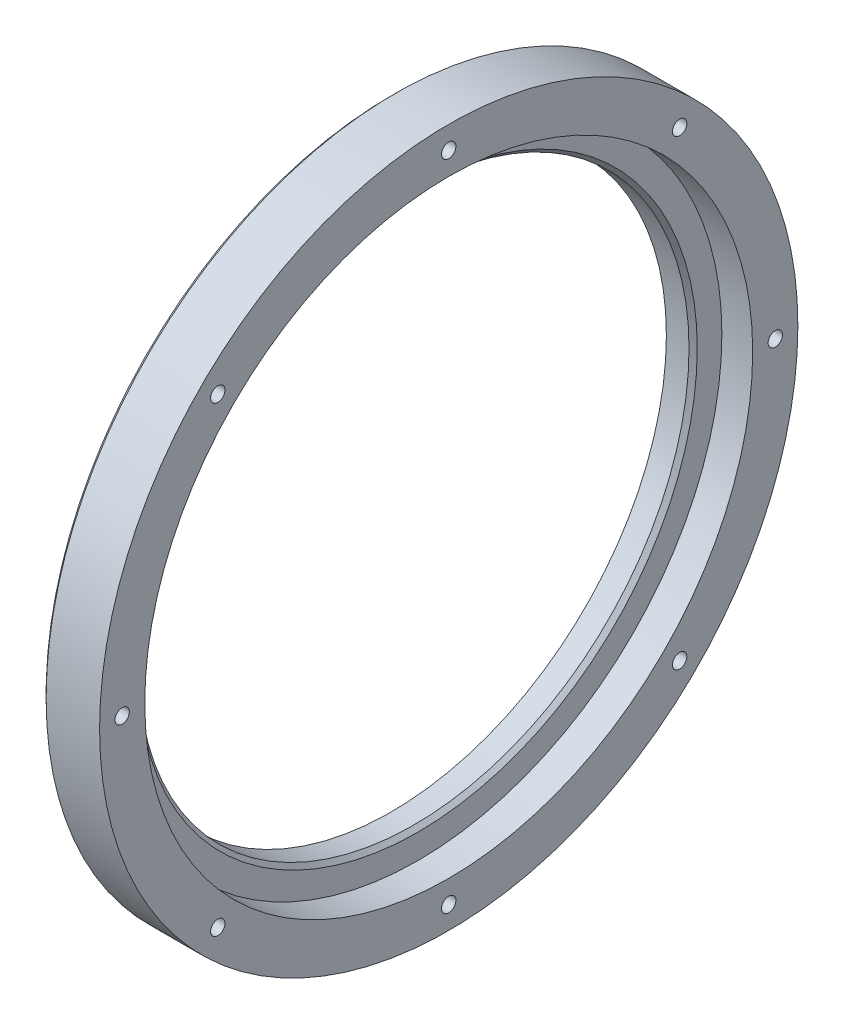
ISO-10303-21;
HEADER;
FILE_DESCRIPTION(('STEP AP214'),'2;1');
FILE_NAME('part.step','',(''),(''),'','','');
FILE_SCHEMA(('AUTOMOTIVE_DESIGN { 1 0 10303 214 1 1 1 1 }'));
ENDSEC;
DATA;
#1=APPLICATION_CONTEXT('core data for automotive mechanical design processes');
#2=APPLICATION_PROTOCOL_DEFINITION('international standard','automotive_design',2000,#1);
#3=PRODUCT_CONTEXT('',#1,'mechanical');
#4=PRODUCT('Part','Part','',(#3));
#5=PRODUCT_RELATED_PRODUCT_CATEGORY('part','',(#4));
#6=PRODUCT_DEFINITION_FORMATION('','',#4);
#7=PRODUCT_DEFINITION_CONTEXT('part definition',#1,'design');
#8=PRODUCT_DEFINITION('design','',#6,#7);
#9=PRODUCT_DEFINITION_SHAPE('','',#8);
#10=(LENGTH_UNIT() NAMED_UNIT(*) SI_UNIT(.MILLI.,.METRE.));
#11=(NAMED_UNIT(*) PLANE_ANGLE_UNIT() SI_UNIT($,.RADIAN.));
#12=(NAMED_UNIT(*) SI_UNIT($,.STERADIAN.) SOLID_ANGLE_UNIT());
#13=UNCERTAINTY_MEASURE_WITH_UNIT(LENGTH_MEASURE(1.E-05),#10,'distance_accuracy_value','');
#14=(GEOMETRIC_REPRESENTATION_CONTEXT(3) GLOBAL_UNCERTAINTY_ASSIGNED_CONTEXT((#13)) GLOBAL_UNIT_ASSIGNED_CONTEXT((#10,
#11,#12)) REPRESENTATION_CONTEXT('',''));
#15=CARTESIAN_POINT('',(0.,0.,0.));
#16=DIRECTION('',(0.,0.,1.));
#17=DIRECTION('',(1.,0.,0.));
#18=AXIS2_PLACEMENT_3D('',#15,#16,#17);
#19=CARTESIAN_POINT('',(-272.858046522507,57.2242590790327,56.2149891043305));
#20=DIRECTION('',(-1.,0.,0.));
#21=DIRECTION('',(0.,0.,1.));
#22=AXIS2_PLACEMENT_3D('',#19,#20,#21);
#23=CYLINDRICAL_SURFACE('',#22,1.75000000000001);
#24=CARTESIAN_POINT('',(-272.858046522507,57.2242590790327,56.2149891043305));
#25=DIRECTION('',(-1.,0.,0.));
#26=DIRECTION('',(0.,0.,1.));
#27=AXIS2_PLACEMENT_3D('',#24,#25,#26);
#28=CIRCLE('',#27,1.75000000000001);
#29=CARTESIAN_POINT('',(-272.858046522507,57.2242590790327,57.9649891043306));
#30=VERTEX_POINT('',#29);
#31=EDGE_CURVE('E90',#30,#30,#28,.T.);
#32=ORIENTED_EDGE('',*,*,#31,.F.);
#33=EDGE_LOOP('',(#32));
#34=FACE_BOUND('',#33,.T.);
#35=CARTESIAN_POINT('',(-282.871214875946,57.2242590790327,56.2149891043305));
#36=DIRECTION('',(-1.,0.,0.));
#37=DIRECTION('',(0.,0.,1.));
#38=AXIS2_PLACEMENT_3D('',#35,#36,#37);
#39=CIRCLE('',#38,1.75000000000001);
#40=CARTESIAN_POINT('',(-282.871214875946,57.2242590790327,57.9649891043306));
#41=VERTEX_POINT('',#40);
#42=EDGE_CURVE('E53',#41,#41,#39,.F.);
#43=ORIENTED_EDGE('',*,*,#42,.F.);
#44=EDGE_LOOP('',(#43));
#45=FACE_BOUND('',#44,.T.);
#46=ADVANCED_FACE('F35',(#34,#45),#23,.F.);
#47=CARTESIAN_POINT('',(-272.858046522507,80.5092699747022,0.));
#48=DIRECTION('',(-1.,0.,0.));
#49=DIRECTION('',(0.,0.,1.));
#50=AXIS2_PLACEMENT_3D('',#47,#48,#49);
#51=CYLINDRICAL_SURFACE('',#50,1.75000000000001);
#52=CARTESIAN_POINT('',(-272.858046522507,80.5092699747022,0.));
#53=DIRECTION('',(-1.,0.,0.));
#54=DIRECTION('',(0.,0.,1.));
#55=AXIS2_PLACEMENT_3D('',#52,#53,#54);
#56=CIRCLE('',#55,1.75000000000001);
#57=CARTESIAN_POINT('',(-272.858046522507,80.5092699747022,1.75000000000001));
#58=VERTEX_POINT('',#57);
#59=EDGE_CURVE('E125',#58,#58,#56,.T.);
#60=ORIENTED_EDGE('',*,*,#59,.F.);
#61=EDGE_LOOP('',(#60));
#62=FACE_BOUND('',#61,.T.);
#63=CARTESIAN_POINT('',(-282.871214875946,80.5092699747022,0.));
#64=DIRECTION('',(-1.,0.,0.));
#65=DIRECTION('',(0.,0.,1.));
#66=AXIS2_PLACEMENT_3D('',#63,#64,#65);
#67=CIRCLE('',#66,1.75000000000001);
#68=CARTESIAN_POINT('',(-282.871214875946,80.5092699747022,1.75000000000001));
#69=VERTEX_POINT('',#68);
#70=EDGE_CURVE('E58',#69,#69,#67,.F.);
#71=ORIENTED_EDGE('',*,*,#70,.F.);
#72=EDGE_LOOP('',(#71));
#73=FACE_BOUND('',#72,.T.);
#74=ADVANCED_FACE('F230',(#62,#73),#51,.F.);
#75=CARTESIAN_POINT('',(-272.858046522507,57.2242590790327,-56.2149891043305));
#76=DIRECTION('',(-1.,0.,0.));
#77=DIRECTION('',(0.,0.,1.));
#78=AXIS2_PLACEMENT_3D('',#75,#76,#77);
#79=CYLINDRICAL_SURFACE('',#78,1.75000000000001);
#80=CARTESIAN_POINT('',(-272.858046522507,57.2242590790327,-56.2149891043305));
#81=DIRECTION('',(-1.,0.,0.));
#82=DIRECTION('',(0.,0.,1.));
#83=AXIS2_PLACEMENT_3D('',#80,#81,#82);
#84=CIRCLE('',#83,1.75000000000001);
#85=CARTESIAN_POINT('',(-272.858046522507,57.2242590790327,-54.4649891043305));
#86=VERTEX_POINT('',#85);
#87=EDGE_CURVE('E122',#86,#86,#84,.T.);
#88=ORIENTED_EDGE('',*,*,#87,.F.);
#89=EDGE_LOOP('',(#88));
#90=FACE_BOUND('',#89,.T.);
#91=CARTESIAN_POINT('',(-282.871214875946,57.2242590790327,-56.2149891043305));
#92=DIRECTION('',(-1.,0.,0.));
#93=DIRECTION('',(0.,0.,1.));
#94=AXIS2_PLACEMENT_3D('',#91,#92,#93);
#95=CIRCLE('',#94,1.75000000000001);
#96=CARTESIAN_POINT('',(-282.871214875946,57.2242590790327,-54.4649891043305));
#97=VERTEX_POINT('',#96);
#98=EDGE_CURVE('E63',#97,#97,#95,.F.);
#99=ORIENTED_EDGE('',*,*,#98,.F.);
#100=EDGE_LOOP('',(#99));
#101=FACE_BOUND('',#100,.T.);
#102=ADVANCED_FACE('F236',(#90,#101),#79,.F.);
#103=CARTESIAN_POINT('',(-272.858046522507,1.00926997470218,-79.5));
#104=DIRECTION('',(-1.,0.,0.));
#105=DIRECTION('',(0.,0.,1.));
#106=AXIS2_PLACEMENT_3D('',#103,#104,#105);
#107=CYLINDRICAL_SURFACE('',#106,1.75);
#108=CARTESIAN_POINT('',(-272.858046522507,1.00926997470218,-79.5));
#109=DIRECTION('',(-1.,0.,0.));
#110=DIRECTION('',(0.,0.,1.));
#111=AXIS2_PLACEMENT_3D('',#108,#109,#110);
#112=CIRCLE('',#111,1.75);
#113=CARTESIAN_POINT('',(-272.858046522507,1.00926997470218,-77.75));
#114=VERTEX_POINT('',#113);
#115=EDGE_CURVE('E119',#114,#114,#112,.T.);
#116=ORIENTED_EDGE('',*,*,#115,.F.);
#117=EDGE_LOOP('',(#116));
#118=FACE_BOUND('',#117,.T.);
#119=CARTESIAN_POINT('',(-282.871214875946,1.00926997470218,-79.5));
#120=DIRECTION('',(-1.,0.,0.));
#121=DIRECTION('',(0.,0.,1.));
#122=AXIS2_PLACEMENT_3D('',#119,#120,#121);
#123=CIRCLE('',#122,1.75);
#124=CARTESIAN_POINT('',(-282.871214875946,1.00926997470218,-77.75));
#125=VERTEX_POINT('',#124);
#126=EDGE_CURVE('E68',#125,#125,#123,.F.);
#127=ORIENTED_EDGE('',*,*,#126,.F.);
#128=EDGE_LOOP('',(#127));
#129=FACE_BOUND('',#128,.T.);
#130=ADVANCED_FACE('F247',(#118,#129),#107,.F.);
#131=CARTESIAN_POINT('',(-272.858046522507,-55.2057191296284,-56.2149891043306));
#132=DIRECTION('',(-1.,0.,0.));
#133=DIRECTION('',(0.,0.,1.));
#134=AXIS2_PLACEMENT_3D('',#131,#132,#133);
#135=CYLINDRICAL_SURFACE('',#134,1.75000000000001);
#136=CARTESIAN_POINT('',(-272.858046522507,-55.2057191296284,-56.2149891043306));
#137=DIRECTION('',(-1.,0.,0.));
#138=DIRECTION('',(0.,0.,1.));
#139=AXIS2_PLACEMENT_3D('',#136,#137,#138);
#140=CIRCLE('',#139,1.75000000000001);
#141=CARTESIAN_POINT('',(-272.858046522507,-55.2057191296284,-54.4649891043305));
#142=VERTEX_POINT('',#141);
#143=EDGE_CURVE('E116',#142,#142,#140,.T.);
#144=ORIENTED_EDGE('',*,*,#143,.F.);
#145=EDGE_LOOP('',(#144));
#146=FACE_BOUND('',#145,.T.);
#147=CARTESIAN_POINT('',(-282.871214875946,-55.2057191296284,-56.2149891043306));
#148=DIRECTION('',(-1.,0.,0.));
#149=DIRECTION('',(0.,0.,1.));
#150=AXIS2_PLACEMENT_3D('',#147,#148,#149);
#151=CIRCLE('',#150,1.75000000000001);
#152=CARTESIAN_POINT('',(-282.871214875946,-55.2057191296284,-54.4649891043305));
#153=VERTEX_POINT('',#152);
#154=EDGE_CURVE('E73',#153,#153,#151,.F.);
#155=ORIENTED_EDGE('',*,*,#154,.F.);
#156=EDGE_LOOP('',(#155));
#157=FACE_BOUND('',#156,.T.);
#158=ADVANCED_FACE('F251',(#146,#157),#135,.F.);
#159=CARTESIAN_POINT('',(-272.858046522507,-78.4907300252979,0.));
#160=DIRECTION('',(-1.,0.,0.));
#161=DIRECTION('',(0.,0.,1.));
#162=AXIS2_PLACEMENT_3D('',#159,#160,#161);
#163=CYLINDRICAL_SURFACE('',#162,1.75000000000001);
#164=CARTESIAN_POINT('',(-272.858046522507,-78.4907300252979,0.));
#165=DIRECTION('',(-1.,0.,0.));
#166=DIRECTION('',(0.,0.,1.));
#167=AXIS2_PLACEMENT_3D('',#164,#165,#166);
#168=CIRCLE('',#167,1.75000000000001);
#169=CARTESIAN_POINT('',(-272.858046522507,-78.4907300252979,1.75));
#170=VERTEX_POINT('',#169);
#171=EDGE_CURVE('E113',#170,#170,#168,.T.);
#172=ORIENTED_EDGE('',*,*,#171,.F.);
#173=EDGE_LOOP('',(#172));
#174=FACE_BOUND('',#173,.T.);
#175=CARTESIAN_POINT('',(-282.871214875946,-78.4907300252979,0.));
#176=DIRECTION('',(-1.,0.,0.));
#177=DIRECTION('',(0.,0.,1.));
#178=AXIS2_PLACEMENT_3D('',#175,#176,#177);
#179=CIRCLE('',#178,1.75000000000001);
#180=CARTESIAN_POINT('',(-282.871214875946,-78.4907300252979,1.75));
#181=VERTEX_POINT('',#180);
#182=EDGE_CURVE('E78',#181,#181,#179,.F.);
#183=ORIENTED_EDGE('',*,*,#182,.F.);
#184=EDGE_LOOP('',(#183));
#185=FACE_BOUND('',#184,.T.);
#186=ADVANCED_FACE('F255',(#174,#185),#163,.F.);
#187=CARTESIAN_POINT('',(-272.858046522507,-55.2057191296284,56.2149891043305));
#188=DIRECTION('',(-1.,0.,0.));
#189=DIRECTION('',(0.,0.,1.));
#190=AXIS2_PLACEMENT_3D('',#187,#188,#189);
#191=CYLINDRICAL_SURFACE('',#190,1.75000000000001);
#192=CARTESIAN_POINT('',(-272.858046522507,-55.2057191296284,56.2149891043305));
#193=DIRECTION('',(-1.,0.,0.));
#194=DIRECTION('',(0.,0.,1.));
#195=AXIS2_PLACEMENT_3D('',#192,#193,#194);
#196=CIRCLE('',#195,1.75000000000001);
#197=CARTESIAN_POINT('',(-272.858046522507,-55.2057191296284,57.9649891043306));
#198=VERTEX_POINT('',#197);
#199=EDGE_CURVE('E110',#198,#198,#196,.T.);
#200=ORIENTED_EDGE('',*,*,#199,.F.);
#201=EDGE_LOOP('',(#200));
#202=FACE_BOUND('',#201,.T.);
#203=CARTESIAN_POINT('',(-282.871214875946,-55.2057191296284,56.2149891043305));
#204=DIRECTION('',(-1.,0.,0.));
#205=DIRECTION('',(0.,0.,1.));
#206=AXIS2_PLACEMENT_3D('',#203,#204,#205);
#207=CIRCLE('',#206,1.75000000000001);
#208=CARTESIAN_POINT('',(-282.871214875946,-55.2057191296284,57.9649891043306));
#209=VERTEX_POINT('',#208);
#210=EDGE_CURVE('E83',#209,#209,#207,.F.);
#211=ORIENTED_EDGE('',*,*,#210,.F.);
#212=EDGE_LOOP('',(#211));
#213=FACE_BOUND('',#212,.T.);
#214=ADVANCED_FACE('F259',(#202,#213),#191,.F.);
#215=CARTESIAN_POINT('',(-272.858046522507,1.00926997470216,79.5));
#216=DIRECTION('',(-1.,0.,0.));
#217=DIRECTION('',(0.,0.,1.));
#218=AXIS2_PLACEMENT_3D('',#215,#216,#217);
#219=CYLINDRICAL_SURFACE('',#218,1.75000000000001);
#220=CARTESIAN_POINT('',(-272.858046522507,1.00926997470216,79.5));
#221=DIRECTION('',(-1.,0.,0.));
#222=DIRECTION('',(0.,0.,1.));
#223=AXIS2_PLACEMENT_3D('',#220,#221,#222);
#224=CIRCLE('',#223,1.75000000000001);
#225=CARTESIAN_POINT('',(-272.858046522507,1.00926997470216,81.25));
#226=VERTEX_POINT('',#225);
#227=EDGE_CURVE('E107',#226,#226,#224,.T.);
#228=ORIENTED_EDGE('',*,*,#227,.F.);
#229=EDGE_LOOP('',(#228));
#230=FACE_BOUND('',#229,.T.);
#231=CARTESIAN_POINT('',(-282.871214875946,1.00926997470216,79.5));
#232=DIRECTION('',(-1.,0.,0.));
#233=DIRECTION('',(0.,0.,1.));
#234=AXIS2_PLACEMENT_3D('',#231,#232,#233);
#235=CIRCLE('',#234,1.75000000000001);
#236=CARTESIAN_POINT('',(-282.871214875946,1.00926997470216,81.25));
#237=VERTEX_POINT('',#236);
#238=EDGE_CURVE('E88',#237,#237,#235,.F.);
#239=ORIENTED_EDGE('',*,*,#238,.F.);
#240=EDGE_LOOP('',(#239));
#241=FACE_BOUND('',#240,.T.);
#242=ADVANCED_FACE('F213',(#230,#241),#219,.F.);
#243=CARTESIAN_POINT('',(-272.858046522507,75.0092699747022,0.));
#244=DIRECTION('',(1.,0.,0.));
#245=DIRECTION('',(0.,0.,-1.));
#246=AXIS2_PLACEMENT_3D('',#243,#244,#245);
#247=PLANE('',#246);
#248=ORIENTED_EDGE('',*,*,#31,.T.);
#249=EDGE_LOOP('',(#248));
#250=FACE_BOUND('',#249,.T.);
#251=ORIENTED_EDGE('',*,*,#59,.T.);
#252=EDGE_LOOP('',(#251));
#253=FACE_BOUND('',#252,.T.);
#254=ORIENTED_EDGE('',*,*,#87,.T.);
#255=EDGE_LOOP('',(#254));
#256=FACE_BOUND('',#255,.T.);
#257=ORIENTED_EDGE('',*,*,#115,.T.);
#258=EDGE_LOOP('',(#257));
#259=FACE_BOUND('',#258,.T.);
#260=ORIENTED_EDGE('',*,*,#143,.T.);
#261=EDGE_LOOP('',(#260));
#262=FACE_BOUND('',#261,.T.);
#263=ORIENTED_EDGE('',*,*,#171,.T.);
#264=EDGE_LOOP('',(#263));
#265=FACE_BOUND('',#264,.T.);
#266=ORIENTED_EDGE('',*,*,#199,.T.);
#267=EDGE_LOOP('',(#266));
#268=FACE_BOUND('',#267,.T.);
#269=ORIENTED_EDGE('',*,*,#227,.T.);
#270=EDGE_LOOP('',(#269));
#271=FACE_BOUND('',#270,.T.);
#272=CARTESIAN_POINT('',(-272.858046522507,1.00926997470217,0.));
#273=DIRECTION('',(1.,0.,0.));
#274=DIRECTION('',(0.,0.,-1.));
#275=AXIS2_PLACEMENT_3D('',#272,#273,#274);
#276=CIRCLE('',#275,85.);
#277=CARTESIAN_POINT('',(-272.858046522507,1.00926997470217,-85.));
#278=VERTEX_POINT('',#277);
#279=EDGE_CURVE('E104',#278,#278,#276,.T.);
#280=ORIENTED_EDGE('',*,*,#279,.T.);
#281=EDGE_LOOP('',(#280));
#282=FACE_BOUND('',#281,.T.);
#283=CARTESIAN_POINT('',(-272.858046522507,1.00926997470217,0.));
#284=DIRECTION('',(1.,0.,0.));
#285=DIRECTION('',(0.,0.,-1.));
#286=AXIS2_PLACEMENT_3D('',#283,#284,#285);
#287=CIRCLE('',#286,74.);
#288=CARTESIAN_POINT('',(-272.858046522507,1.00926997470217,-74.));
#289=VERTEX_POINT('',#288);
#290=EDGE_CURVE('E46',#289,#289,#287,.T.);
#291=ORIENTED_EDGE('',*,*,#290,.F.);
#292=EDGE_LOOP('',(#291));
#293=FACE_BOUND('',#292,.T.);
#294=ADVANCED_FACE('F209',(#250,#253,#256,#259,#262,#265,#268,#271,#282,#293),#247,.T.);
#295=CARTESIAN_POINT('',(-268.908046522507,1.00926997470217,0.));
#296=DIRECTION('',(1.,0.,0.));
#297=DIRECTION('',(0.,0.,-1.));
#298=AXIS2_PLACEMENT_3D('',#295,#296,#297);
#299=CYLINDRICAL_SURFACE('',#298,74.);
#300=ORIENTED_EDGE('',*,*,#290,.T.);
#301=EDGE_LOOP('',(#300));
#302=FACE_BOUND('',#301,.T.);
#303=CARTESIAN_POINT('',(-280.358046522507,1.00926997470217,0.));
#304=DIRECTION('',(1.,0.,0.));
#305=DIRECTION('',(0.,0.,-1.));
#306=AXIS2_PLACEMENT_3D('',#303,#304,#305);
#307=CIRCLE('',#306,74.);
#308=CARTESIAN_POINT('',(-280.358046522507,1.00926997470217,-74.));
#309=VERTEX_POINT('',#308);
#310=EDGE_CURVE('E50',#309,#309,#307,.T.);
#311=ORIENTED_EDGE('',*,*,#310,.F.);
#312=EDGE_LOOP('',(#311));
#313=FACE_BOUND('',#312,.T.);
#314=ADVANCED_FACE('F212',(#302,#313),#299,.F.);
#315=CARTESIAN_POINT('',(-280.358046522507,75.0092699747022,0.));
#316=DIRECTION('',(1.,0.,0.));
#317=DIRECTION('',(0.,0.,-1.));
#318=AXIS2_PLACEMENT_3D('',#315,#316,#317);
#319=PLANE('',#318);
#320=CARTESIAN_POINT('',(-280.358046522507,1.00926997470217,0.));
#321=DIRECTION('',(1.,0.,0.));
#322=DIRECTION('',(0.,0.,-1.));
#323=AXIS2_PLACEMENT_3D('',#320,#321,#322);
#324=CIRCLE('',#323,68.);
#325=CARTESIAN_POINT('',(-280.358046522507,1.00926997470217,-68.));
#326=VERTEX_POINT('',#325);
#327=EDGE_CURVE('E10',#326,#326,#324,.F.);
#328=ORIENTED_EDGE('',*,*,#327,.T.);
#329=EDGE_LOOP('',(#328));
#330=FACE_BOUND('',#329,.T.);
#331=ORIENTED_EDGE('',*,*,#310,.T.);
#332=EDGE_LOOP('',(#331));
#333=FACE_BOUND('',#332,.T.);
#334=ADVANCED_FACE('F219',(#330,#333),#319,.T.);
#335=CARTESIAN_POINT('',(-268.908046522507,1.00926997470217,0.));
#336=DIRECTION('',(1.,0.,0.));
#337=DIRECTION('',(0.,0.,-1.));
#338=AXIS2_PLACEMENT_3D('',#335,#336,#337);
#339=CYLINDRICAL_SURFACE('',#338,67.);
#340=CARTESIAN_POINT('',(-281.358046522507,1.00926997470217,0.));
#341=DIRECTION('',(1.,0.,0.));
#342=DIRECTION('',(0.,0.,-1.));
#343=AXIS2_PLACEMENT_3D('',#340,#341,#342);
#344=CIRCLE('',#343,67.);
#345=CARTESIAN_POINT('',(-281.358046522507,1.00926997470217,-67.));
#346=VERTEX_POINT('',#345);
#347=EDGE_CURVE('E42',#346,#346,#344,.T.);
#348=ORIENTED_EDGE('',*,*,#347,.T.);
#349=EDGE_LOOP('',(#348));
#350=FACE_BOUND('',#349,.T.);
#351=CARTESIAN_POINT('',(-286.871214875946,1.00926997470217,0.));
#352=DIRECTION('',(1.,0.,0.));
#353=DIRECTION('',(0.,0.,-1.));
#354=AXIS2_PLACEMENT_3D('',#351,#352,#353);
#355=CIRCLE('',#354,67.);
#356=CARTESIAN_POINT('',(-286.871214875946,1.00926997470217,-67.));
#357=VERTEX_POINT('',#356);
#358=EDGE_CURVE('E95',#357,#357,#355,.T.);
#359=ORIENTED_EDGE('',*,*,#358,.F.);
#360=EDGE_LOOP('',(#359));
#361=FACE_BOUND('',#360,.T.);
#362=ADVANCED_FACE('F177',(#350,#361),#339,.F.);
#363=CARTESIAN_POINT('',(-286.871214875946,68.0092699747022,0.));
#364=DIRECTION('',(-1.,0.,0.));
#365=DIRECTION('',(0.,0.,1.));
#366=AXIS2_PLACEMENT_3D('',#363,#364,#365);
#367=PLANE('',#366);
#368=CARTESIAN_POINT('',(-286.871214875946,57.2242590790327,56.2149891043305));
#369=DIRECTION('',(-1.,0.,0.));
#370=DIRECTION('',(0.,0.,1.));
#371=AXIS2_PLACEMENT_3D('',#368,#369,#370);
#372=CIRCLE('',#371,3.00000000000002);
#373=CARTESIAN_POINT('',(-286.871214875946,57.2242590790327,59.2149891043306));
#374=VERTEX_POINT('',#373);
#375=EDGE_CURVE('E158',#374,#374,#372,.T.);
#376=ORIENTED_EDGE('',*,*,#375,.F.);
#377=EDGE_LOOP('',(#376));
#378=FACE_BOUND('',#377,.T.);
#379=CARTESIAN_POINT('',(-286.871214875946,80.5092699747022,0.));
#380=DIRECTION('',(-1.,0.,0.));
#381=DIRECTION('',(0.,0.,1.));
#382=AXIS2_PLACEMENT_3D('',#379,#380,#381);
#383=CIRCLE('',#382,3.00000000000001);
#384=CARTESIAN_POINT('',(-286.871214875946,80.5092699747022,3.00000000000001));
#385=VERTEX_POINT('',#384);
#386=EDGE_CURVE('E56',#385,#385,#383,.T.);
#387=ORIENTED_EDGE('',*,*,#386,.F.);
#388=EDGE_LOOP('',(#387));
#389=FACE_BOUND('',#388,.T.);
#390=CARTESIAN_POINT('',(-286.871214875946,57.2242590790327,-56.2149891043305));
#391=DIRECTION('',(-1.,0.,0.));
#392=DIRECTION('',(0.,0.,1.));
#393=AXIS2_PLACEMENT_3D('',#390,#391,#392);
#394=CIRCLE('',#393,3.00000000000001);
#395=CARTESIAN_POINT('',(-286.871214875946,57.2242590790327,-53.2149891043305));
#396=VERTEX_POINT('',#395);
#397=EDGE_CURVE('E61',#396,#396,#394,.T.);
#398=ORIENTED_EDGE('',*,*,#397,.F.);
#399=EDGE_LOOP('',(#398));
#400=FACE_BOUND('',#399,.T.);
#401=CARTESIAN_POINT('',(-286.871214875946,1.00926997470217,-79.5));
#402=DIRECTION('',(-1.,0.,0.));
#403=DIRECTION('',(0.,0.,1.));
#404=AXIS2_PLACEMENT_3D('',#401,#402,#403);
#405=CIRCLE('',#404,3.00000000000002);
#406=CARTESIAN_POINT('',(-286.871214875946,1.00926997470217,-76.5));
#407=VERTEX_POINT('',#406);
#408=EDGE_CURVE('E66',#407,#407,#405,.T.);
#409=ORIENTED_EDGE('',*,*,#408,.F.);
#410=EDGE_LOOP('',(#409));
#411=FACE_BOUND('',#410,.T.);
#412=CARTESIAN_POINT('',(-286.871214875946,-55.2057191296284,-56.2149891043306));
#413=DIRECTION('',(-1.,0.,0.));
#414=DIRECTION('',(0.,0.,1.));
#415=AXIS2_PLACEMENT_3D('',#412,#413,#414);
#416=CIRCLE('',#415,3.00000000000001);
#417=CARTESIAN_POINT('',(-286.871214875946,-55.2057191296284,-53.2149891043305));
#418=VERTEX_POINT('',#417);
#419=EDGE_CURVE('E71',#418,#418,#416,.T.);
#420=ORIENTED_EDGE('',*,*,#419,.F.);
#421=EDGE_LOOP('',(#420));
#422=FACE_BOUND('',#421,.T.);
#423=CARTESIAN_POINT('',(-286.871214875946,-78.4907300252979,0.));
#424=DIRECTION('',(-1.,0.,0.));
#425=DIRECTION('',(0.,0.,1.));
#426=AXIS2_PLACEMENT_3D('',#423,#424,#425);
#427=CIRCLE('',#426,3.00000000000002);
#428=CARTESIAN_POINT('',(-286.871214875946,-78.4907300252979,3.00000000000001));
#429=VERTEX_POINT('',#428);
#430=EDGE_CURVE('E76',#429,#429,#427,.T.);
#431=ORIENTED_EDGE('',*,*,#430,.F.);
#432=EDGE_LOOP('',(#431));
#433=FACE_BOUND('',#432,.T.);
#434=CARTESIAN_POINT('',(-286.871214875946,-55.2057191296284,56.2149891043305));
#435=DIRECTION('',(-1.,0.,0.));
#436=DIRECTION('',(0.,0.,1.));
#437=AXIS2_PLACEMENT_3D('',#434,#435,#436);
#438=CIRCLE('',#437,3.00000000000002);
#439=CARTESIAN_POINT('',(-286.871214875946,-55.2057191296284,59.2149891043306));
#440=VERTEX_POINT('',#439);
#441=EDGE_CURVE('E81',#440,#440,#438,.T.);
#442=ORIENTED_EDGE('',*,*,#441,.F.);
#443=EDGE_LOOP('',(#442));
#444=FACE_BOUND('',#443,.T.);
#445=CARTESIAN_POINT('',(-286.871214875946,1.00926997470216,79.5));
#446=DIRECTION('',(-1.,0.,0.));
#447=DIRECTION('',(0.,0.,1.));
#448=AXIS2_PLACEMENT_3D('',#445,#446,#447);
#449=CIRCLE('',#448,3.00000000000002);
#450=CARTESIAN_POINT('',(-286.871214875946,1.00926997470216,82.5));
#451=VERTEX_POINT('',#450);
#452=EDGE_CURVE('E86',#451,#451,#449,.T.);
#453=ORIENTED_EDGE('',*,*,#452,.F.);
#454=EDGE_LOOP('',(#453));
#455=FACE_BOUND('',#454,.T.);
#456=ORIENTED_EDGE('',*,*,#358,.T.);
#457=EDGE_LOOP('',(#456));
#458=FACE_BOUND('',#457,.T.);
#459=CARTESIAN_POINT('',(-286.871214875946,1.00926997470217,0.));
#460=DIRECTION('',(1.,0.,0.));
#461=DIRECTION('',(0.,0.,-1.));
#462=AXIS2_PLACEMENT_3D('',#459,#460,#461);
#463=CIRCLE('',#462,84.);
#464=CARTESIAN_POINT('',(-286.871214875946,1.00926997470217,-84.));
#465=VERTEX_POINT('',#464);
#466=EDGE_CURVE('E98',#465,#465,#463,.T.);
#467=ORIENTED_EDGE('',*,*,#466,.F.);
#468=EDGE_LOOP('',(#467));
#469=FACE_BOUND('',#468,.T.);
#470=ADVANCED_FACE('F173',(#378,#389,#400,#411,#422,#433,#444,#455,#458,#469),#367,.T.);
#471=CARTESIAN_POINT('',(-285.871214875946,1.00926997470217,0.));
#472=DIRECTION('',(1.,0.,0.));
#473=DIRECTION('',(0.,0.,-1.));
#474=AXIS2_PLACEMENT_3D('',#471,#472,#473);
#475=CONICAL_SURFACE('',#474,85.,0.785398163397448);
#476=ORIENTED_EDGE('',*,*,#466,.T.);
#477=EDGE_LOOP('',(#476));
#478=FACE_BOUND('',#477,.T.);
#479=CARTESIAN_POINT('',(-285.871214875946,1.00926997470217,0.));
#480=DIRECTION('',(1.,0.,0.));
#481=DIRECTION('',(0.,0.,-1.));
#482=AXIS2_PLACEMENT_3D('',#479,#480,#481);
#483=CIRCLE('',#482,85.);
#484=CARTESIAN_POINT('',(-285.871214875946,1.00926997470217,-85.));
#485=VERTEX_POINT('',#484);
#486=EDGE_CURVE('E101',#485,#485,#483,.T.);
#487=ORIENTED_EDGE('',*,*,#486,.F.);
#488=EDGE_LOOP('',(#487));
#489=FACE_BOUND('',#488,.T.);
#490=ADVANCED_FACE('F176',(#478,#489),#475,.T.);
#491=CARTESIAN_POINT('',(-268.908046522507,1.00926997470217,0.));
#492=DIRECTION('',(1.,0.,0.));
#493=DIRECTION('',(0.,0.,-1.));
#494=AXIS2_PLACEMENT_3D('',#491,#492,#493);
#495=CYLINDRICAL_SURFACE('',#494,85.);
#496=ORIENTED_EDGE('',*,*,#486,.T.);
#497=EDGE_LOOP('',(#496));
#498=FACE_BOUND('',#497,.T.);
#499=ORIENTED_EDGE('',*,*,#279,.F.);
#500=EDGE_LOOP('',(#499));
#501=FACE_BOUND('',#500,.T.);
#502=ADVANCED_FACE('F199',(#498,#501),#495,.T.);
#503=CARTESIAN_POINT('',(-282.871214875946,1.00926997470216,79.5));
#504=DIRECTION('',(-1.,0.,0.));
#505=DIRECTION('',(0.,0.,1.));
#506=AXIS2_PLACEMENT_3D('',#503,#504,#505);
#507=PLANE('',#506);
#508=CARTESIAN_POINT('',(-282.871214875946,1.00926997470216,79.5));
#509=DIRECTION('',(-1.,0.,0.));
#510=DIRECTION('',(0.,0.,1.));
#511=AXIS2_PLACEMENT_3D('',#508,#509,#510);
#512=CIRCLE('',#511,3.00000000000002);
#513=CARTESIAN_POINT('',(-282.871214875946,1.00926997470216,82.5));
#514=VERTEX_POINT('',#513);
#515=EDGE_CURVE('E91',#514,#514,#512,.T.);
#516=ORIENTED_EDGE('',*,*,#515,.T.);
#517=EDGE_LOOP('',(#516));
#518=FACE_BOUND('',#517,.T.);
#519=ORIENTED_EDGE('',*,*,#238,.T.);
#520=EDGE_LOOP('',(#519));
#521=FACE_BOUND('',#520,.T.);
#522=ADVANCED_FACE('F205',(#518,#521),#507,.T.);
#523=CARTESIAN_POINT('',(-282.871214875946,1.00926997470216,79.5));
#524=DIRECTION('',(-1.,0.,0.));
#525=DIRECTION('',(0.,0.,1.));
#526=AXIS2_PLACEMENT_3D('',#523,#524,#525);
#527=CYLINDRICAL_SURFACE('',#526,3.00000000000002);
#528=ORIENTED_EDGE('',*,*,#515,.F.);
#529=EDGE_LOOP('',(#528));
#530=FACE_BOUND('',#529,.T.);
#531=ORIENTED_EDGE('',*,*,#452,.T.);
#532=EDGE_LOOP('',(#531));
#533=FACE_BOUND('',#532,.T.);
#534=ADVANCED_FACE('F242',(#530,#533),#527,.F.);
#535=CARTESIAN_POINT('',(-282.871214875946,-55.2057191296284,56.2149891043305));
#536=DIRECTION('',(-1.,0.,0.));
#537=DIRECTION('',(0.,0.,1.));
#538=AXIS2_PLACEMENT_3D('',#535,#536,#537);
#539=PLANE('',#538);
#540=CARTESIAN_POINT('',(-282.871214875946,-55.2057191296284,56.2149891043305));
#541=DIRECTION('',(-1.,0.,0.));
#542=DIRECTION('',(0.,0.,1.));
#543=AXIS2_PLACEMENT_3D('',#540,#541,#542);
#544=CIRCLE('',#543,3.00000000000002);
#545=CARTESIAN_POINT('',(-282.871214875946,-55.2057191296284,59.2149891043306));
#546=VERTEX_POINT('',#545);
#547=EDGE_CURVE('E87',#546,#546,#544,.T.);
#548=ORIENTED_EDGE('',*,*,#547,.T.);
#549=EDGE_LOOP('',(#548));
#550=FACE_BOUND('',#549,.T.);
#551=ORIENTED_EDGE('',*,*,#210,.T.);
#552=EDGE_LOOP('',(#551));
#553=FACE_BOUND('',#552,.T.);
#554=ADVANCED_FACE('F277',(#550,#553),#539,.T.);
#555=CARTESIAN_POINT('',(-282.871214875946,-55.2057191296284,56.2149891043305));
#556=DIRECTION('',(-1.,0.,0.));
#557=DIRECTION('',(0.,0.,1.));
#558=AXIS2_PLACEMENT_3D('',#555,#556,#557);
#559=CYLINDRICAL_SURFACE('',#558,3.00000000000002);
#560=ORIENTED_EDGE('',*,*,#547,.F.);
#561=EDGE_LOOP('',(#560));
#562=FACE_BOUND('',#561,.T.);
#563=ORIENTED_EDGE('',*,*,#441,.T.);
#564=EDGE_LOOP('',(#563));
#565=FACE_BOUND('',#564,.T.);
#566=ADVANCED_FACE('F280',(#562,#565),#559,.F.);
#567=CARTESIAN_POINT('',(-282.871214875946,-78.4907300252979,0.));
#568=DIRECTION('',(-1.,0.,0.));
#569=DIRECTION('',(0.,0.,1.));
#570=AXIS2_PLACEMENT_3D('',#567,#568,#569);
#571=PLANE('',#570);
#572=CARTESIAN_POINT('',(-282.871214875946,-78.4907300252979,0.));
#573=DIRECTION('',(-1.,0.,0.));
#574=DIRECTION('',(0.,0.,1.));
#575=AXIS2_PLACEMENT_3D('',#572,#573,#574);
#576=CIRCLE('',#575,3.00000000000002);
#577=CARTESIAN_POINT('',(-282.871214875946,-78.4907300252979,3.00000000000001));
#578=VERTEX_POINT('',#577);
#579=EDGE_CURVE('E82',#578,#578,#576,.T.);
#580=ORIENTED_EDGE('',*,*,#579,.T.);
#581=EDGE_LOOP('',(#580));
#582=FACE_BOUND('',#581,.T.);
#583=ORIENTED_EDGE('',*,*,#182,.T.);
#584=EDGE_LOOP('',(#583));
#585=FACE_BOUND('',#584,.T.);
#586=ADVANCED_FACE('F283',(#582,#585),#571,.T.);
#587=CARTESIAN_POINT('',(-282.871214875946,-78.4907300252979,0.));
#588=DIRECTION('',(-1.,0.,0.));
#589=DIRECTION('',(0.,0.,1.));
#590=AXIS2_PLACEMENT_3D('',#587,#588,#589);
#591=CYLINDRICAL_SURFACE('',#590,3.00000000000002);
#592=ORIENTED_EDGE('',*,*,#579,.F.);
#593=EDGE_LOOP('',(#592));
#594=FACE_BOUND('',#593,.T.);
#595=ORIENTED_EDGE('',*,*,#430,.T.);
#596=EDGE_LOOP('',(#595));
#597=FACE_BOUND('',#596,.T.);
#598=ADVANCED_FACE('F288',(#594,#597),#591,.F.);
#599=CARTESIAN_POINT('',(-282.871214875946,-55.2057191296284,-56.2149891043306));
#600=DIRECTION('',(-1.,0.,0.));
#601=DIRECTION('',(0.,0.,1.));
#602=AXIS2_PLACEMENT_3D('',#599,#600,#601);
#603=PLANE('',#602);
#604=CARTESIAN_POINT('',(-282.871214875946,-55.2057191296284,-56.2149891043306));
#605=DIRECTION('',(-1.,0.,0.));
#606=DIRECTION('',(0.,0.,1.));
#607=AXIS2_PLACEMENT_3D('',#604,#605,#606);
#608=CIRCLE('',#607,3.00000000000001);
#609=CARTESIAN_POINT('',(-282.871214875946,-55.2057191296284,-53.2149891043305));
#610=VERTEX_POINT('',#609);
#611=EDGE_CURVE('E77',#610,#610,#608,.T.);
#612=ORIENTED_EDGE('',*,*,#611,.T.);
#613=EDGE_LOOP('',(#612));
#614=FACE_BOUND('',#613,.T.);
#615=ORIENTED_EDGE('',*,*,#154,.T.);
#616=EDGE_LOOP('',(#615));
#617=FACE_BOUND('',#616,.T.);
#618=ADVANCED_FACE('F291',(#614,#617),#603,.T.);
#619=CARTESIAN_POINT('',(-282.871214875946,-55.2057191296284,-56.2149891043306));
#620=DIRECTION('',(-1.,0.,0.));
#621=DIRECTION('',(0.,0.,1.));
#622=AXIS2_PLACEMENT_3D('',#619,#620,#621);
#623=CYLINDRICAL_SURFACE('',#622,3.00000000000001);
#624=ORIENTED_EDGE('',*,*,#611,.F.);
#625=EDGE_LOOP('',(#624));
#626=FACE_BOUND('',#625,.T.);
#627=ORIENTED_EDGE('',*,*,#419,.T.);
#628=EDGE_LOOP('',(#627));
#629=FACE_BOUND('',#628,.T.);
#630=ADVANCED_FACE('F296',(#626,#629),#623,.F.);
#631=CARTESIAN_POINT('',(-282.871214875946,1.00926997470217,-79.5));
#632=DIRECTION('',(-1.,0.,0.));
#633=DIRECTION('',(0.,0.,1.));
#634=AXIS2_PLACEMENT_3D('',#631,#632,#633);
#635=PLANE('',#634);
#636=CARTESIAN_POINT('',(-282.871214875946,1.00926997470217,-79.5));
#637=DIRECTION('',(-1.,0.,0.));
#638=DIRECTION('',(0.,0.,1.));
#639=AXIS2_PLACEMENT_3D('',#636,#637,#638);
#640=CIRCLE('',#639,3.00000000000002);
#641=CARTESIAN_POINT('',(-282.871214875946,1.00926997470217,-76.5));
#642=VERTEX_POINT('',#641);
#643=EDGE_CURVE('E72',#642,#642,#640,.T.);
#644=ORIENTED_EDGE('',*,*,#643,.T.);
#645=EDGE_LOOP('',(#644));
#646=FACE_BOUND('',#645,.T.);
#647=ORIENTED_EDGE('',*,*,#126,.T.);
#648=EDGE_LOOP('',(#647));
#649=FACE_BOUND('',#648,.T.);
#650=ADVANCED_FACE('F299',(#646,#649),#635,.T.);
#651=CARTESIAN_POINT('',(-282.871214875946,1.00926997470217,-79.5));
#652=DIRECTION('',(-1.,0.,0.));
#653=DIRECTION('',(0.,0.,1.));
#654=AXIS2_PLACEMENT_3D('',#651,#652,#653);
#655=CYLINDRICAL_SURFACE('',#654,3.00000000000002);
#656=ORIENTED_EDGE('',*,*,#643,.F.);
#657=EDGE_LOOP('',(#656));
#658=FACE_BOUND('',#657,.T.);
#659=ORIENTED_EDGE('',*,*,#408,.T.);
#660=EDGE_LOOP('',(#659));
#661=FACE_BOUND('',#660,.T.);
#662=ADVANCED_FACE('F304',(#658,#661),#655,.F.);
#663=CARTESIAN_POINT('',(-282.871214875946,57.2242590790327,-56.2149891043305));
#664=DIRECTION('',(-1.,0.,0.));
#665=DIRECTION('',(0.,0.,1.));
#666=AXIS2_PLACEMENT_3D('',#663,#664,#665);
#667=PLANE('',#666);
#668=CARTESIAN_POINT('',(-282.871214875946,57.2242590790327,-56.2149891043305));
#669=DIRECTION('',(-1.,0.,0.));
#670=DIRECTION('',(0.,0.,1.));
#671=AXIS2_PLACEMENT_3D('',#668,#669,#670);
#672=CIRCLE('',#671,3.00000000000001);
#673=CARTESIAN_POINT('',(-282.871214875946,57.2242590790327,-53.2149891043305));
#674=VERTEX_POINT('',#673);
#675=EDGE_CURVE('E67',#674,#674,#672,.T.);
#676=ORIENTED_EDGE('',*,*,#675,.T.);
#677=EDGE_LOOP('',(#676));
#678=FACE_BOUND('',#677,.T.);
#679=ORIENTED_EDGE('',*,*,#98,.T.);
#680=EDGE_LOOP('',(#679));
#681=FACE_BOUND('',#680,.T.);
#682=ADVANCED_FACE('F307',(#678,#681),#667,.T.);
#683=CARTESIAN_POINT('',(-282.871214875946,57.2242590790327,-56.2149891043305));
#684=DIRECTION('',(-1.,0.,0.));
#685=DIRECTION('',(0.,0.,1.));
#686=AXIS2_PLACEMENT_3D('',#683,#684,#685);
#687=CYLINDRICAL_SURFACE('',#686,3.00000000000001);
#688=ORIENTED_EDGE('',*,*,#675,.F.);
#689=EDGE_LOOP('',(#688));
#690=FACE_BOUND('',#689,.T.);
#691=ORIENTED_EDGE('',*,*,#397,.T.);
#692=EDGE_LOOP('',(#691));
#693=FACE_BOUND('',#692,.T.);
#694=ADVANCED_FACE('F312',(#690,#693),#687,.F.);
#695=CARTESIAN_POINT('',(-282.871214875946,80.5092699747022,0.));
#696=DIRECTION('',(-1.,0.,0.));
#697=DIRECTION('',(0.,0.,1.));
#698=AXIS2_PLACEMENT_3D('',#695,#696,#697);
#699=PLANE('',#698);
#700=CARTESIAN_POINT('',(-282.871214875946,80.5092699747022,0.));
#701=DIRECTION('',(-1.,0.,0.));
#702=DIRECTION('',(0.,0.,1.));
#703=AXIS2_PLACEMENT_3D('',#700,#701,#702);
#704=CIRCLE('',#703,3.00000000000001);
#705=CARTESIAN_POINT('',(-282.871214875946,80.5092699747022,3.00000000000001));
#706=VERTEX_POINT('',#705);
#707=EDGE_CURVE('E62',#706,#706,#704,.T.);
#708=ORIENTED_EDGE('',*,*,#707,.T.);
#709=EDGE_LOOP('',(#708));
#710=FACE_BOUND('',#709,.T.);
#711=ORIENTED_EDGE('',*,*,#70,.T.);
#712=EDGE_LOOP('',(#711));
#713=FACE_BOUND('',#712,.T.);
#714=ADVANCED_FACE('F315',(#710,#713),#699,.T.);
#715=CARTESIAN_POINT('',(-282.871214875946,80.5092699747022,0.));
#716=DIRECTION('',(-1.,0.,0.));
#717=DIRECTION('',(0.,0.,1.));
#718=AXIS2_PLACEMENT_3D('',#715,#716,#717);
#719=CYLINDRICAL_SURFACE('',#718,3.00000000000001);
#720=ORIENTED_EDGE('',*,*,#707,.F.);
#721=EDGE_LOOP('',(#720));
#722=FACE_BOUND('',#721,.T.);
#723=ORIENTED_EDGE('',*,*,#386,.T.);
#724=EDGE_LOOP('',(#723));
#725=FACE_BOUND('',#724,.T.);
#726=ADVANCED_FACE('F320',(#722,#725),#719,.F.);
#727=CARTESIAN_POINT('',(-282.871214875946,57.2242590790327,56.2149891043305));
#728=DIRECTION('',(-1.,0.,0.));
#729=DIRECTION('',(0.,0.,1.));
#730=AXIS2_PLACEMENT_3D('',#727,#728,#729);
#731=PLANE('',#730);
#732=CARTESIAN_POINT('',(-282.871214875946,57.2242590790327,56.2149891043305));
#733=DIRECTION('',(-1.,0.,0.));
#734=DIRECTION('',(0.,0.,1.));
#735=AXIS2_PLACEMENT_3D('',#732,#733,#734);
#736=CIRCLE('',#735,3.00000000000002);
#737=CARTESIAN_POINT('',(-282.871214875946,57.2242590790327,59.2149891043306));
#738=VERTEX_POINT('',#737);
#739=EDGE_CURVE('E57',#738,#738,#736,.T.);
#740=ORIENTED_EDGE('',*,*,#739,.T.);
#741=EDGE_LOOP('',(#740));
#742=FACE_BOUND('',#741,.T.);
#743=ORIENTED_EDGE('',*,*,#42,.T.);
#744=EDGE_LOOP('',(#743));
#745=FACE_BOUND('',#744,.T.);
#746=ADVANCED_FACE('F164',(#742,#745),#731,.T.);
#747=CARTESIAN_POINT('',(-282.871214875946,57.2242590790327,56.2149891043305));
#748=DIRECTION('',(-1.,0.,0.));
#749=DIRECTION('',(0.,0.,1.));
#750=AXIS2_PLACEMENT_3D('',#747,#748,#749);
#751=CYLINDRICAL_SURFACE('',#750,3.00000000000002);
#752=ORIENTED_EDGE('',*,*,#739,.F.);
#753=EDGE_LOOP('',(#752));
#754=FACE_BOUND('',#753,.T.);
#755=ORIENTED_EDGE('',*,*,#375,.T.);
#756=EDGE_LOOP('',(#755));
#757=FACE_BOUND('',#756,.T.);
#758=ADVANCED_FACE('F167',(#754,#757),#751,.F.);
#759=CARTESIAN_POINT('',(-281.358046522507,1.00926997470217,0.));
#760=DIRECTION('',(1.,0.,0.));
#761=DIRECTION('',(0.,0.,-1.));
#762=AXIS2_PLACEMENT_3D('',#759,#760,#761);
#763=CONICAL_SURFACE('',#762,67.,0.785398163397455);
#764=ORIENTED_EDGE('',*,*,#327,.F.);
#765=EDGE_LOOP('',(#764));
#766=FACE_BOUND('',#765,.T.);
#767=ORIENTED_EDGE('',*,*,#347,.F.);
#768=EDGE_LOOP('',(#767));
#769=FACE_BOUND('',#768,.T.);
#770=ADVANCED_FACE('F37',(#766,#769),#763,.F.);
#771=CLOSED_SHELL('',(#46,#74,#102,#130,#158,#186,#214,#242,#294,#314,#334,#362,#470,#490,#502,
#522,#534,#554,#566,#586,#598,#618,#630,#650,#662,#682,#694,#714,#726,#746,#758,#770));
#772=MANIFOLD_SOLID_BREP('B2',#771);
#773=ADVANCED_BREP_SHAPE_REPRESENTATION('',(#18,#772),#14);
#774=SHAPE_DEFINITION_REPRESENTATION(#9,#773);
ENDSEC;
END-ISO-10303-21;
